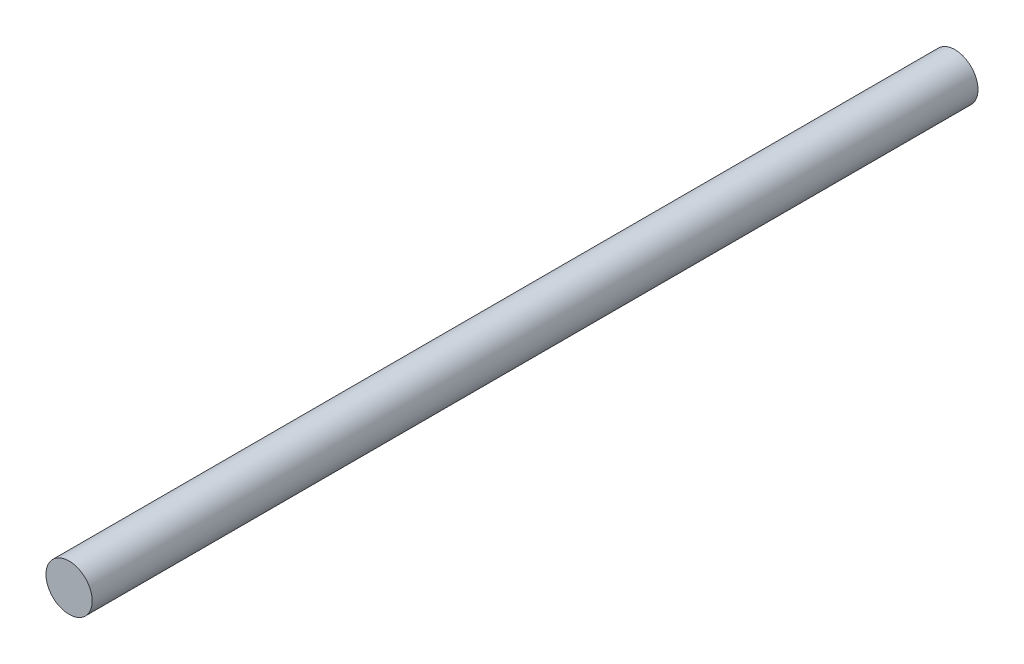
ISO-10303-21;
HEADER;
FILE_DESCRIPTION(('STEP AP214'),'2;1');
FILE_NAME('part.step','',(''),(''),'','','');
FILE_SCHEMA(('AUTOMOTIVE_DESIGN { 1 0 10303 214 1 1 1 1 }'));
ENDSEC;
DATA;
#1=APPLICATION_CONTEXT('core data for automotive mechanical design processes');
#2=APPLICATION_PROTOCOL_DEFINITION('international standard','automotive_design',2000,#1);
#3=PRODUCT_CONTEXT('',#1,'mechanical');
#4=PRODUCT('Part','Part','',(#3));
#5=PRODUCT_RELATED_PRODUCT_CATEGORY('part','',(#4));
#6=PRODUCT_DEFINITION_FORMATION('','',#4);
#7=PRODUCT_DEFINITION_CONTEXT('part definition',#1,'design');
#8=PRODUCT_DEFINITION('design','',#6,#7);
#9=PRODUCT_DEFINITION_SHAPE('','',#8);
#10=(LENGTH_UNIT() NAMED_UNIT(*) SI_UNIT(.MILLI.,.METRE.));
#11=(NAMED_UNIT(*) PLANE_ANGLE_UNIT() SI_UNIT($,.RADIAN.));
#12=(NAMED_UNIT(*) SI_UNIT($,.STERADIAN.) SOLID_ANGLE_UNIT());
#13=UNCERTAINTY_MEASURE_WITH_UNIT(LENGTH_MEASURE(1.E-05),#10,'distance_accuracy_value','');
#14=(GEOMETRIC_REPRESENTATION_CONTEXT(3) GLOBAL_UNCERTAINTY_ASSIGNED_CONTEXT((#13)) GLOBAL_UNIT_ASSIGNED_CONTEXT((#10,
#11,#12)) REPRESENTATION_CONTEXT('',''));
#15=CARTESIAN_POINT('',(0.,0.,0.));
#16=DIRECTION('',(0.,0.,1.));
#17=DIRECTION('',(1.,0.,0.));
#18=AXIS2_PLACEMENT_3D('',#15,#16,#17);
#19=CARTESIAN_POINT('',(-26.924,0.,-24.2202561210692));
#20=DIRECTION('',(0.,0.,1.));
#21=DIRECTION('',(1.,0.,0.));
#22=AXIS2_PLACEMENT_3D('',#19,#20,#21);
#23=CYLINDRICAL_SURFACE('',#22,3.17499999999995);
#24=CARTESIAN_POINT('',(-26.924,0.,-15.2400000000001));
#25=DIRECTION('',(0.,0.,1.));
#26=DIRECTION('',(1.,0.,0.));
#27=AXIS2_PLACEMENT_3D('',#24,#25,#26);
#28=CIRCLE('',#27,3.17499999999995);
#29=CARTESIAN_POINT('',(-23.7490000000001,0.,-15.2400000000001));
#30=VERTEX_POINT('',#29);
#31=EDGE_CURVE('E10',#30,#30,#28,.F.);
#32=ORIENTED_EDGE('',*,*,#31,.F.);
#33=EDGE_LOOP('',(#32));
#34=FACE_BOUND('',#33,.T.);
#35=CARTESIAN_POINT('',(-26.924,0.,106.36504));
#36=DIRECTION('',(0.,0.,1.));
#37=DIRECTION('',(1.,0.,0.));
#38=AXIS2_PLACEMENT_3D('',#35,#36,#37);
#39=CIRCLE('',#38,3.17499999999995);
#40=CARTESIAN_POINT('',(-23.7490000000001,0.,106.36504));
#41=VERTEX_POINT('',#40);
#42=EDGE_CURVE('E39',#41,#41,#39,.T.);
#43=ORIENTED_EDGE('',*,*,#42,.F.);
#44=EDGE_LOOP('',(#43));
#45=FACE_BOUND('',#44,.T.);
#46=ADVANCED_FACE('F33',(#34,#45),#23,.T.);
#47=CARTESIAN_POINT('',(-26.924,0.,106.36504));
#48=DIRECTION('',(0.,0.,1.));
#49=DIRECTION('',(1.,0.,0.));
#50=AXIS2_PLACEMENT_3D('',#47,#48,#49);
#51=PLANE('',#50);
#52=ORIENTED_EDGE('',*,*,#42,.T.);
#53=EDGE_LOOP('',(#52));
#54=FACE_BOUND('',#53,.T.);
#55=ADVANCED_FACE('F45',(#54),#51,.T.);
#56=CARTESIAN_POINT('',(0.,0.,-15.2400000000001));
#57=DIRECTION('',(0.,0.,1.));
#58=DIRECTION('',(1.,0.,0.));
#59=AXIS2_PLACEMENT_3D('',#56,#57,#58);
#60=PLANE('',#59);
#61=ORIENTED_EDGE('',*,*,#31,.T.);
#62=EDGE_LOOP('',(#61));
#63=FACE_BOUND('',#62,.T.);
#64=ADVANCED_FACE('F52',(#63),#60,.F.);
#65=CLOSED_SHELL('',(#46,#55,#64));
#66=MANIFOLD_SOLID_BREP('B2',#65);
#67=ADVANCED_BREP_SHAPE_REPRESENTATION('',(#18,#66),#14);
#68=SHAPE_DEFINITION_REPRESENTATION(#9,#67);
ENDSEC;
END-ISO-10303-21;
